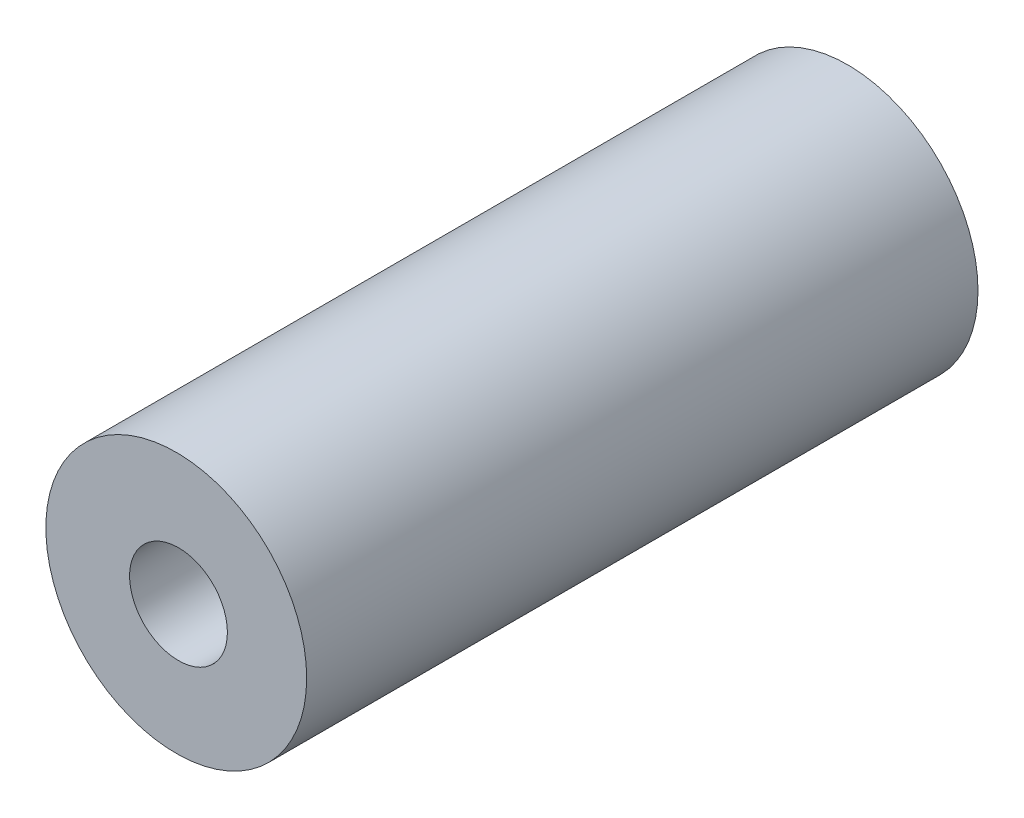
ISO-10303-21;
HEADER;
FILE_DESCRIPTION(('STEP AP214'),'2;1');
FILE_NAME('part.step','',(''),(''),'','','');
FILE_SCHEMA(('AUTOMOTIVE_DESIGN { 1 0 10303 214 1 1 1 1 }'));
ENDSEC;
DATA;
#1=APPLICATION_CONTEXT('core data for automotive mechanical design processes');
#2=APPLICATION_PROTOCOL_DEFINITION('international standard','automotive_design',2000,#1);
#3=PRODUCT_CONTEXT('',#1,'mechanical');
#4=PRODUCT('Part','Part','',(#3));
#5=PRODUCT_RELATED_PRODUCT_CATEGORY('part','',(#4));
#6=PRODUCT_DEFINITION_FORMATION('','',#4);
#7=PRODUCT_DEFINITION_CONTEXT('part definition',#1,'design');
#8=PRODUCT_DEFINITION('design','',#6,#7);
#9=PRODUCT_DEFINITION_SHAPE('','',#8);
#10=(LENGTH_UNIT() NAMED_UNIT(*) SI_UNIT(.MILLI.,.METRE.));
#11=(NAMED_UNIT(*) PLANE_ANGLE_UNIT() SI_UNIT($,.RADIAN.));
#12=(NAMED_UNIT(*) SI_UNIT($,.STERADIAN.) SOLID_ANGLE_UNIT());
#13=UNCERTAINTY_MEASURE_WITH_UNIT(LENGTH_MEASURE(1.E-05),#10,'distance_accuracy_value','');
#14=(GEOMETRIC_REPRESENTATION_CONTEXT(3) GLOBAL_UNCERTAINTY_ASSIGNED_CONTEXT((#13)) GLOBAL_UNIT_ASSIGNED_CONTEXT((#10,
#11,#12)) REPRESENTATION_CONTEXT('',''));
#15=CARTESIAN_POINT('',(0.,0.,0.));
#16=DIRECTION('',(0.,0.,1.));
#17=DIRECTION('',(1.,0.,0.));
#18=AXIS2_PLACEMENT_3D('',#15,#16,#17);
#19=CARTESIAN_POINT('',(-0.0685633053647862,0.,20.59));
#20=DIRECTION('',(0.,0.,1.));
#21=DIRECTION('',(1.,0.,0.));
#22=AXIS2_PLACEMENT_3D('',#19,#20,#21);
#23=PLANE('',#22);
#24=CARTESIAN_POINT('',(-0.0685633053647862,0.,20.59));
#25=DIRECTION('',(0.,0.,1.));
#26=DIRECTION('',(1.,0.,0.));
#27=AXIS2_PLACEMENT_3D('',#24,#25,#26);
#28=CIRCLE('',#27,4.);
#29=CARTESIAN_POINT('',(3.93143669463521,0.,20.59));
#30=VERTEX_POINT('',#29);
#31=EDGE_CURVE('E10',#30,#30,#28,.T.);
#32=ORIENTED_EDGE('',*,*,#31,.T.);
#33=EDGE_LOOP('',(#32));
#34=FACE_BOUND('',#33,.T.);
#35=CARTESIAN_POINT('',(0.,0.,20.59));
#36=DIRECTION('',(0.,0.,1.));
#37=DIRECTION('',(1.,0.,0.));
#38=AXIS2_PLACEMENT_3D('',#35,#36,#37);
#39=CIRCLE('',#38,1.5);
#40=CARTESIAN_POINT('',(1.5,0.,20.59));
#41=VERTEX_POINT('',#40);
#42=EDGE_CURVE('E50',#41,#41,#39,.T.);
#43=ORIENTED_EDGE('',*,*,#42,.F.);
#44=EDGE_LOOP('',(#43));
#45=FACE_BOUND('',#44,.T.);
#46=ADVANCED_FACE('F37',(#34,#45),#23,.T.);
#47=CARTESIAN_POINT('',(-0.0685633053647862,0.,0.));
#48=DIRECTION('',(0.,0.,1.));
#49=DIRECTION('',(1.,0.,0.));
#50=AXIS2_PLACEMENT_3D('',#47,#48,#49);
#51=PLANE('',#50);
#52=CARTESIAN_POINT('',(-0.0685633053647862,0.,0.));
#53=DIRECTION('',(0.,0.,1.));
#54=DIRECTION('',(1.,0.,0.));
#55=AXIS2_PLACEMENT_3D('',#52,#53,#54);
#56=CIRCLE('',#55,4.);
#57=CARTESIAN_POINT('',(3.93143669463521,0.,0.));
#58=VERTEX_POINT('',#57);
#59=EDGE_CURVE('E41',#58,#58,#56,.T.);
#60=ORIENTED_EDGE('',*,*,#59,.F.);
#61=EDGE_LOOP('',(#60));
#62=FACE_BOUND('',#61,.T.);
#63=CARTESIAN_POINT('',(0.,0.,0.));
#64=DIRECTION('',(0.,0.,1.));
#65=DIRECTION('',(1.,0.,0.));
#66=AXIS2_PLACEMENT_3D('',#63,#64,#65);
#67=CIRCLE('',#66,1.5);
#68=CARTESIAN_POINT('',(1.5,0.,0.));
#69=VERTEX_POINT('',#68);
#70=EDGE_CURVE('E52',#69,#69,#67,.T.);
#71=ORIENTED_EDGE('',*,*,#70,.T.);
#72=EDGE_LOOP('',(#71));
#73=FACE_BOUND('',#72,.T.);
#74=ADVANCED_FACE('F64',(#62,#73),#51,.F.);
#75=CARTESIAN_POINT('',(-0.0685633053647862,0.,20.59));
#76=DIRECTION('',(0.,0.,-1.));
#77=DIRECTION('',(-1.,0.,0.));
#78=AXIS2_PLACEMENT_3D('',#75,#76,#77);
#79=CYLINDRICAL_SURFACE('',#78,4.);
#80=ORIENTED_EDGE('',*,*,#31,.F.);
#81=EDGE_LOOP('',(#80));
#82=FACE_BOUND('',#81,.T.);
#83=ORIENTED_EDGE('',*,*,#59,.T.);
#84=EDGE_LOOP('',(#83));
#85=FACE_BOUND('',#84,.T.);
#86=ADVANCED_FACE('F39',(#82,#85),#79,.T.);
#87=CARTESIAN_POINT('',(0.,0.,20.59));
#88=DIRECTION('',(0.,0.,-1.));
#89=DIRECTION('',(-1.,0.,0.));
#90=AXIS2_PLACEMENT_3D('',#87,#88,#89);
#91=CYLINDRICAL_SURFACE('',#90,1.5);
#92=ORIENTED_EDGE('',*,*,#42,.T.);
#93=EDGE_LOOP('',(#92));
#94=FACE_BOUND('',#93,.T.);
#95=ORIENTED_EDGE('',*,*,#70,.F.);
#96=EDGE_LOOP('',(#95));
#97=FACE_BOUND('',#96,.T.);
#98=ADVANCED_FACE('F60',(#94,#97),#91,.F.);
#99=CLOSED_SHELL('',(#46,#74,#86,#98));
#100=MANIFOLD_SOLID_BREP('B2',#99);
#101=ADVANCED_BREP_SHAPE_REPRESENTATION('',(#18,#100),#14);
#102=SHAPE_DEFINITION_REPRESENTATION(#9,#101);
ENDSEC;
END-ISO-10303-21;
